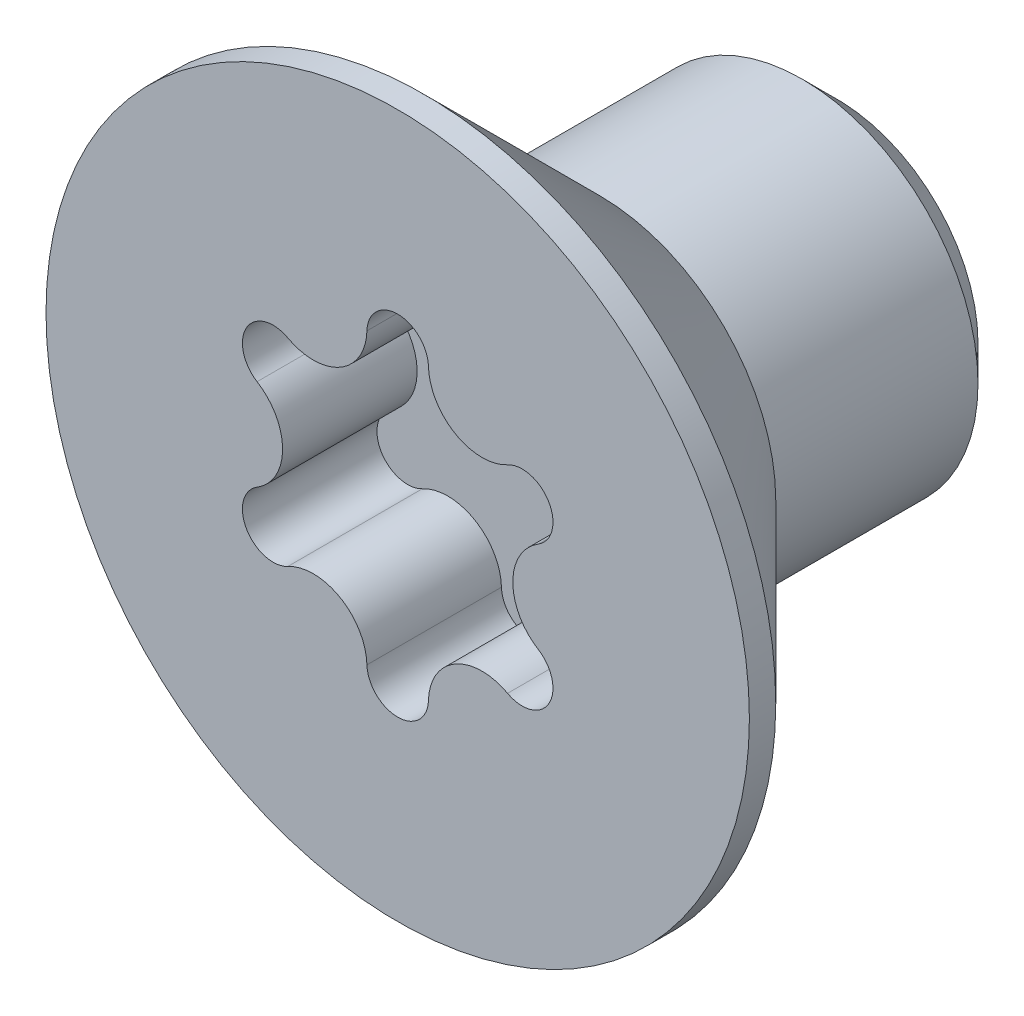
ISO-10303-21;
HEADER;
FILE_DESCRIPTION(('STEP AP214'),'2;1');
FILE_NAME('part.step','',(''),(''),'','','');
FILE_SCHEMA(('AUTOMOTIVE_DESIGN { 1 0 10303 214 1 1 1 1 }'));
ENDSEC;
DATA;
#1=APPLICATION_CONTEXT('core data for automotive mechanical design processes');
#2=APPLICATION_PROTOCOL_DEFINITION('international standard','automotive_design',2000,#1);
#3=PRODUCT_CONTEXT('',#1,'mechanical');
#4=PRODUCT('Part','Part','',(#3));
#5=PRODUCT_RELATED_PRODUCT_CATEGORY('part','',(#4));
#6=PRODUCT_DEFINITION_FORMATION('','',#4);
#7=PRODUCT_DEFINITION_CONTEXT('part definition',#1,'design');
#8=PRODUCT_DEFINITION('design','',#6,#7);
#9=PRODUCT_DEFINITION_SHAPE('','',#8);
#10=(LENGTH_UNIT() NAMED_UNIT(*) SI_UNIT(.MILLI.,.METRE.));
#11=(NAMED_UNIT(*) PLANE_ANGLE_UNIT() SI_UNIT($,.RADIAN.));
#12=(NAMED_UNIT(*) SI_UNIT($,.STERADIAN.) SOLID_ANGLE_UNIT());
#13=UNCERTAINTY_MEASURE_WITH_UNIT(LENGTH_MEASURE(1.E-05),#10,'distance_accuracy_value','');
#14=(GEOMETRIC_REPRESENTATION_CONTEXT(3) GLOBAL_UNCERTAINTY_ASSIGNED_CONTEXT((#13)) GLOBAL_UNIT_ASSIGNED_CONTEXT((#10,
#11,#12)) REPRESENTATION_CONTEXT('',''));
#15=CARTESIAN_POINT('',(0.,0.,0.));
#16=DIRECTION('',(0.,0.,1.));
#17=DIRECTION('',(1.,0.,0.));
#18=AXIS2_PLACEMENT_3D('',#15,#16,#17);
#19=CARTESIAN_POINT('',(0.,0.,2.3));
#20=DIRECTION('',(0.,0.,1.));
#21=DIRECTION('',(1.,0.,0.));
#22=AXIS2_PLACEMENT_3D('',#19,#20,#21);
#23=PLANE('',#22);
#24=CARTESIAN_POINT('',(0.,0.,2.3));
#25=DIRECTION('',(0.,0.,1.));
#26=DIRECTION('',(1.,0.,0.));
#27=AXIS2_PLACEMENT_3D('',#24,#25,#26);
#28=CIRCLE('',#27,4.);
#29=CARTESIAN_POINT('',(4.,0.,2.3));
#30=VERTEX_POINT('',#29);
#31=EDGE_CURVE('E11',#30,#30,#28,.T.);
#32=ORIENTED_EDGE('',*,*,#31,.T.);
#33=EDGE_LOOP('',(#32));
#34=FACE_BOUND('',#33,.T.);
#35=CARTESIAN_POINT('',(1.415951535188,-0.8175,2.3));
#36=DIRECTION('',(0.,0.,-1.));
#37=DIRECTION('',(1.,0.,0.));
#38=AXIS2_PLACEMENT_3D('',#35,#36,#37);
#39=CIRCLE('',#38,0.35);
#40=CARTESIAN_POINT('',(1.599440118764,-0.519453125,2.3));
#41=VERTEX_POINT('',#40);
#42=CARTESIAN_POINT('',(1.249579661707,-1.125429212181,2.3));
#43=VERTEX_POINT('',#42);
#44=EDGE_CURVE('E27',#41,#43,#39,.T.);
#45=ORIENTED_EDGE('',*,*,#44,.T.);
#46=CARTESIAN_POINT('',(0.959617253641,-1.662105839126,2.3));
#47=DIRECTION('',(0.,0.,1.));
#48=DIRECTION('',(1.,0.,0.));
#49=AXIS2_PLACEMENT_3D('',#46,#47,#48);
#50=CIRCLE('',#49,0.61);
#51=CARTESIAN_POINT('',(0.349860457057,-1.644882337181,2.3));
#52=VERTEX_POINT('',#51);
#53=EDGE_CURVE('E175',#43,#52,#50,.T.);
#54=ORIENTED_EDGE('',*,*,#53,.T.);
#55=CARTESIAN_POINT('',(0.,-1.635,2.3));
#56=DIRECTION('',(0.,0.,-1.));
#57=DIRECTION('',(1.,0.,0.));
#58=AXIS2_PLACEMENT_3D('',#55,#56,#57);
#59=CIRCLE('',#58,0.35);
#60=CARTESIAN_POINT('',(-0.349860457057,-1.644882337181,2.3));
#61=VERTEX_POINT('',#60);
#62=EDGE_CURVE('E179',#52,#61,#59,.T.);
#63=ORIENTED_EDGE('',*,*,#62,.T.);
#64=CARTESIAN_POINT('',(-0.959617253641,-1.662105839126,2.3));
#65=DIRECTION('',(0.,0.,1.));
#66=DIRECTION('',(1.,0.,0.));
#67=AXIS2_PLACEMENT_3D('',#64,#65,#66);
#68=CIRCLE('',#67,0.61);
#69=CARTESIAN_POINT('',(-1.249579661707,-1.125429212181,2.3));
#70=VERTEX_POINT('',#69);
#71=EDGE_CURVE('E227',#61,#70,#68,.T.);
#72=ORIENTED_EDGE('',*,*,#71,.T.);
#73=CARTESIAN_POINT('',(-1.415951535188,-0.8175,2.3));
#74=DIRECTION('',(0.,0.,-1.));
#75=DIRECTION('',(1.,0.,0.));
#76=AXIS2_PLACEMENT_3D('',#73,#74,#75);
#77=CIRCLE('',#76,0.35);
#78=CARTESIAN_POINT('',(-1.599440118764,-0.519453125,2.3));
#79=VERTEX_POINT('',#78);
#80=EDGE_CURVE('E223',#70,#79,#77,.T.);
#81=ORIENTED_EDGE('',*,*,#80,.T.);
#82=CARTESIAN_POINT('',(-1.919234507282,0.,2.3));
#83=DIRECTION('',(0.,0.,1.));
#84=DIRECTION('',(1.,0.,0.));
#85=AXIS2_PLACEMENT_3D('',#82,#83,#84);
#86=CIRCLE('',#85,0.61);
#87=CARTESIAN_POINT('',(-1.599440118764,0.519453125,2.3));
#88=VERTEX_POINT('',#87);
#89=EDGE_CURVE('E163',#79,#88,#86,.T.);
#90=ORIENTED_EDGE('',*,*,#89,.T.);
#91=CARTESIAN_POINT('',(-1.415951535188,0.8175,2.3));
#92=DIRECTION('',(0.,0.,-1.));
#93=DIRECTION('',(1.,0.,0.));
#94=AXIS2_PLACEMENT_3D('',#91,#92,#93);
#95=CIRCLE('',#94,0.35);
#96=CARTESIAN_POINT('',(-1.249579661707,1.125429212181,2.3));
#97=VERTEX_POINT('',#96);
#98=EDGE_CURVE('E159',#88,#97,#95,.T.);
#99=ORIENTED_EDGE('',*,*,#98,.T.);
#100=CARTESIAN_POINT('',(-0.959617253641,1.662105839126,2.3));
#101=DIRECTION('',(0.,0.,1.));
#102=DIRECTION('',(1.,0.,0.));
#103=AXIS2_PLACEMENT_3D('',#100,#101,#102);
#104=CIRCLE('',#103,0.61);
#105=CARTESIAN_POINT('',(-0.349860457057,1.644882337181,2.3));
#106=VERTEX_POINT('',#105);
#107=EDGE_CURVE('E164',#97,#106,#104,.T.);
#108=ORIENTED_EDGE('',*,*,#107,.T.);
#109=CARTESIAN_POINT('',(0.,1.635,2.3));
#110=DIRECTION('',(0.,0.,-1.));
#111=DIRECTION('',(1.,0.,0.));
#112=AXIS2_PLACEMENT_3D('',#109,#110,#111);
#113=CIRCLE('',#112,0.35);
#114=CARTESIAN_POINT('',(0.349860457057,1.644882337181,2.3));
#115=VERTEX_POINT('',#114);
#116=EDGE_CURVE('E273',#106,#115,#113,.T.);
#117=ORIENTED_EDGE('',*,*,#116,.T.);
#118=CARTESIAN_POINT('',(0.959617253641,1.662105839126,2.3));
#119=DIRECTION('',(0.,0.,1.));
#120=DIRECTION('',(1.,0.,0.));
#121=AXIS2_PLACEMENT_3D('',#118,#119,#120);
#122=CIRCLE('',#121,0.61);
#123=CARTESIAN_POINT('',(1.249579661707,1.125429212181,2.3));
#124=VERTEX_POINT('',#123);
#125=EDGE_CURVE('E195',#115,#124,#122,.T.);
#126=ORIENTED_EDGE('',*,*,#125,.T.);
#127=CARTESIAN_POINT('',(1.415951535188,0.8175,2.3));
#128=DIRECTION('',(0.,0.,-1.));
#129=DIRECTION('',(1.,0.,0.));
#130=AXIS2_PLACEMENT_3D('',#127,#128,#129);
#131=CIRCLE('',#130,0.35);
#132=CARTESIAN_POINT('',(1.599440118764,0.519453125,2.3));
#133=VERTEX_POINT('',#132);
#134=EDGE_CURVE('E126',#124,#133,#131,.T.);
#135=ORIENTED_EDGE('',*,*,#134,.T.);
#136=CARTESIAN_POINT('',(1.919234507282,0.,2.3));
#137=DIRECTION('',(0.,0.,1.));
#138=DIRECTION('',(1.,0.,0.));
#139=AXIS2_PLACEMENT_3D('',#136,#137,#138);
#140=CIRCLE('',#139,0.61);
#141=EDGE_CURVE('E157',#133,#41,#140,.T.);
#142=ORIENTED_EDGE('',*,*,#141,.T.);
#143=EDGE_LOOP('',(#45,#54,#63,#72,#81,#90,#99,#108,#117,#126,#135,#142));
#144=FACE_BOUND('',#143,.T.);
#145=ADVANCED_FACE('F17',(#34,#144),#23,.T.);
#146=CARTESIAN_POINT('',(0.,0.,2.3));
#147=DIRECTION('',(0.,0.,-1.));
#148=DIRECTION('',(1.,0.,0.));
#149=AXIS2_PLACEMENT_3D('',#146,#147,#148);
#150=CYLINDRICAL_SURFACE('',#149,4.);
#151=DIRECTION('',(0.,0.,-1.));
#152=VECTOR('',#151,1.);
#153=CARTESIAN_POINT('',(4.,0.,2.3));
#154=LINE('',#153,#152);
#155=CARTESIAN_POINT('',(4.,0.,2.));
#156=VERTEX_POINT('',#155);
#157=EDGE_CURVE('E155',#30,#156,#154,.T.);
#158=ORIENTED_EDGE('',*,*,#157,.T.);
#159=CARTESIAN_POINT('',(0.,0.,2.));
#160=DIRECTION('',(0.,0.,1.));
#161=DIRECTION('',(1.,0.,0.));
#162=AXIS2_PLACEMENT_3D('',#159,#160,#161);
#163=CIRCLE('',#162,4.);
#164=EDGE_CURVE('E158',#156,#156,#163,.T.);
#165=ORIENTED_EDGE('',*,*,#164,.T.);
#166=ORIENTED_EDGE('',*,*,#157,.F.);
#167=ORIENTED_EDGE('',*,*,#31,.F.);
#168=EDGE_LOOP('',(#158,#165,#166,#167));
#169=FACE_BOUND('',#168,.T.);
#170=ADVANCED_FACE('F361',(#169),#150,.T.);
#171=CARTESIAN_POINT('',(1.919234507282,0.,0.77));
#172=DIRECTION('',(0.,0.,-1.));
#173=DIRECTION('',(1.,0.,0.));
#174=AXIS2_PLACEMENT_3D('',#171,#172,#173);
#175=CYLINDRICAL_SURFACE('',#174,0.61);
#176=CARTESIAN_POINT('',(1.919234507282,0.,0.77));
#177=DIRECTION('',(0.,0.,1.));
#178=DIRECTION('',(1.,0.,0.));
#179=AXIS2_PLACEMENT_3D('',#176,#177,#178);
#180=CIRCLE('',#179,0.61);
#181=CARTESIAN_POINT('',(1.599440118764,0.519453125,0.77));
#182=VERTEX_POINT('',#181);
#183=CARTESIAN_POINT('',(1.599440118764,-0.519453125,0.77));
#184=VERTEX_POINT('',#183);
#185=EDGE_CURVE('E145',#182,#184,#180,.T.);
#186=ORIENTED_EDGE('',*,*,#185,.T.);
#187=DIRECTION('',(0.,0.,1.));
#188=VECTOR('',#187,1.);
#189=CARTESIAN_POINT('',(1.599440118764,-0.519453125,0.77));
#190=LINE('',#189,#188);
#191=EDGE_CURVE('E215',#184,#41,#190,.T.);
#192=ORIENTED_EDGE('',*,*,#191,.T.);
#193=ORIENTED_EDGE('',*,*,#141,.F.);
#194=DIRECTION('',(0.,0.,1.));
#195=VECTOR('',#194,1.);
#196=CARTESIAN_POINT('',(1.599440118764,0.519453125,0.77));
#197=LINE('',#196,#195);
#198=EDGE_CURVE('E147',#182,#133,#197,.T.);
#199=ORIENTED_EDGE('',*,*,#198,.F.);
#200=EDGE_LOOP('',(#186,#192,#193,#199));
#201=FACE_BOUND('',#200,.T.);
#202=ADVANCED_FACE('F366',(#201),#175,.T.);
#203=CARTESIAN_POINT('',(1.415951535188,-0.8175,0.77));
#204=DIRECTION('',(0.,0.,-1.));
#205=DIRECTION('',(1.,0.,0.));
#206=AXIS2_PLACEMENT_3D('',#203,#204,#205);
#207=CYLINDRICAL_SURFACE('',#206,0.35);
#208=CARTESIAN_POINT('',(1.415951535188,-0.8175,0.77));
#209=DIRECTION('',(0.,0.,-1.));
#210=DIRECTION('',(1.,0.,0.));
#211=AXIS2_PLACEMENT_3D('',#208,#209,#210);
#212=CIRCLE('',#211,0.35);
#213=CARTESIAN_POINT('',(1.249579661707,-1.125429212181,0.77));
#214=VERTEX_POINT('',#213);
#215=EDGE_CURVE('E219',#184,#214,#212,.T.);
#216=ORIENTED_EDGE('',*,*,#215,.T.);
#217=DIRECTION('',(0.,0.,1.));
#218=VECTOR('',#217,1.);
#219=CARTESIAN_POINT('',(1.249579661707,-1.125429212181,0.77));
#220=LINE('',#219,#218);
#221=EDGE_CURVE('E233',#214,#43,#220,.T.);
#222=ORIENTED_EDGE('',*,*,#221,.T.);
#223=ORIENTED_EDGE('',*,*,#44,.F.);
#224=ORIENTED_EDGE('',*,*,#191,.F.);
#225=EDGE_LOOP('',(#216,#222,#223,#224));
#226=FACE_BOUND('',#225,.T.);
#227=ADVANCED_FACE('F396',(#226),#207,.F.);
#228=CARTESIAN_POINT('',(0.959617253641,-1.662105839126,0.77));
#229=DIRECTION('',(0.,0.,-1.));
#230=DIRECTION('',(1.,0.,0.));
#231=AXIS2_PLACEMENT_3D('',#228,#229,#230);
#232=CYLINDRICAL_SURFACE('',#231,0.61);
#233=CARTESIAN_POINT('',(0.959617253641,-1.662105839126,0.77));
#234=DIRECTION('',(0.,0.,1.));
#235=DIRECTION('',(1.,0.,0.));
#236=AXIS2_PLACEMENT_3D('',#233,#234,#235);
#237=CIRCLE('',#236,0.61);
#238=CARTESIAN_POINT('',(0.349860457057,-1.644882337181,0.77));
#239=VERTEX_POINT('',#238);
#240=EDGE_CURVE('E232',#214,#239,#237,.T.);
#241=ORIENTED_EDGE('',*,*,#240,.T.);
#242=DIRECTION('',(0.,0.,1.));
#243=VECTOR('',#242,1.);
#244=CARTESIAN_POINT('',(0.349860457057,-1.644882337181,0.77));
#245=LINE('',#244,#243);
#246=EDGE_CURVE('E228',#239,#52,#245,.T.);
#247=ORIENTED_EDGE('',*,*,#246,.T.);
#248=ORIENTED_EDGE('',*,*,#53,.F.);
#249=ORIENTED_EDGE('',*,*,#221,.F.);
#250=EDGE_LOOP('',(#241,#247,#248,#249));
#251=FACE_BOUND('',#250,.T.);
#252=ADVANCED_FACE('F394',(#251),#232,.T.);
#253=CARTESIAN_POINT('',(0.,-1.635,0.77));
#254=DIRECTION('',(0.,0.,-1.));
#255=DIRECTION('',(1.,0.,0.));
#256=AXIS2_PLACEMENT_3D('',#253,#254,#255);
#257=CYLINDRICAL_SURFACE('',#256,0.35);
#258=CARTESIAN_POINT('',(0.,-1.635,0.77));
#259=DIRECTION('',(0.,0.,-1.));
#260=DIRECTION('',(1.,0.,0.));
#261=AXIS2_PLACEMENT_3D('',#258,#259,#260);
#262=CIRCLE('',#261,0.35);
#263=CARTESIAN_POINT('',(-0.349860457057,-1.644882337181,0.77));
#264=VERTEX_POINT('',#263);
#265=EDGE_CURVE('E200',#239,#264,#262,.T.);
#266=ORIENTED_EDGE('',*,*,#265,.T.);
#267=DIRECTION('',(0.,0.,1.));
#268=VECTOR('',#267,1.);
#269=CARTESIAN_POINT('',(-0.349860457057,-1.644882337181,0.77));
#270=LINE('',#269,#268);
#271=EDGE_CURVE('E188',#264,#61,#270,.T.);
#272=ORIENTED_EDGE('',*,*,#271,.T.);
#273=ORIENTED_EDGE('',*,*,#62,.F.);
#274=ORIENTED_EDGE('',*,*,#246,.F.);
#275=EDGE_LOOP('',(#266,#272,#273,#274));
#276=FACE_BOUND('',#275,.T.);
#277=ADVANCED_FACE('F390',(#276),#257,.F.);
#278=CARTESIAN_POINT('',(-0.959617253641,-1.662105839126,0.77));
#279=DIRECTION('',(0.,0.,-1.));
#280=DIRECTION('',(1.,0.,0.));
#281=AXIS2_PLACEMENT_3D('',#278,#279,#280);
#282=CYLINDRICAL_SURFACE('',#281,0.61);
#283=CARTESIAN_POINT('',(-0.959617253641,-1.662105839126,0.77));
#284=DIRECTION('',(0.,0.,1.));
#285=DIRECTION('',(1.,0.,0.));
#286=AXIS2_PLACEMENT_3D('',#283,#284,#285);
#287=CIRCLE('',#286,0.61);
#288=CARTESIAN_POINT('',(-1.249579661707,-1.125429212181,0.77));
#289=VERTEX_POINT('',#288);
#290=EDGE_CURVE('E184',#264,#289,#287,.T.);
#291=ORIENTED_EDGE('',*,*,#290,.T.);
#292=DIRECTION('',(0.,0.,1.));
#293=VECTOR('',#292,1.);
#294=CARTESIAN_POINT('',(-1.249579661707,-1.125429212181,0.77));
#295=LINE('',#294,#293);
#296=EDGE_CURVE('E180',#289,#70,#295,.T.);
#297=ORIENTED_EDGE('',*,*,#296,.T.);
#298=ORIENTED_EDGE('',*,*,#71,.F.);
#299=ORIENTED_EDGE('',*,*,#271,.F.);
#300=EDGE_LOOP('',(#291,#297,#298,#299));
#301=FACE_BOUND('',#300,.T.);
#302=ADVANCED_FACE('F387',(#301),#282,.T.);
#303=CARTESIAN_POINT('',(-1.415951535188,-0.8175,0.77));
#304=DIRECTION('',(0.,0.,-1.));
#305=DIRECTION('',(1.,0.,0.));
#306=AXIS2_PLACEMENT_3D('',#303,#304,#305);
#307=CYLINDRICAL_SURFACE('',#306,0.35);
#308=CARTESIAN_POINT('',(-1.415951535188,-0.8175,0.77));
#309=DIRECTION('',(0.,0.,-1.));
#310=DIRECTION('',(1.,0.,0.));
#311=AXIS2_PLACEMENT_3D('',#308,#309,#310);
#312=CIRCLE('',#311,0.35);
#313=CARTESIAN_POINT('',(-1.599440118764,-0.519453125,0.77));
#314=VERTEX_POINT('',#313);
#315=EDGE_CURVE('E20',#289,#314,#312,.T.);
#316=ORIENTED_EDGE('',*,*,#315,.T.);
#317=DIRECTION('',(0.,0.,1.));
#318=VECTOR('',#317,1.);
#319=CARTESIAN_POINT('',(-1.599440118764,-0.519453125,0.77));
#320=LINE('',#319,#318);
#321=EDGE_CURVE('E244',#314,#79,#320,.T.);
#322=ORIENTED_EDGE('',*,*,#321,.T.);
#323=ORIENTED_EDGE('',*,*,#80,.F.);
#324=ORIENTED_EDGE('',*,*,#296,.F.);
#325=EDGE_LOOP('',(#316,#322,#323,#324));
#326=FACE_BOUND('',#325,.T.);
#327=ADVANCED_FACE('F306',(#326),#307,.F.);
#328=CARTESIAN_POINT('',(-1.919234507282,0.,0.77));
#329=DIRECTION('',(0.,0.,-1.));
#330=DIRECTION('',(1.,0.,0.));
#331=AXIS2_PLACEMENT_3D('',#328,#329,#330);
#332=CYLINDRICAL_SURFACE('',#331,0.61);
#333=CARTESIAN_POINT('',(-1.919234507282,0.,0.77));
#334=DIRECTION('',(0.,0.,1.));
#335=DIRECTION('',(1.,0.,0.));
#336=AXIS2_PLACEMENT_3D('',#333,#334,#335);
#337=CIRCLE('',#336,0.61);
#338=CARTESIAN_POINT('',(-1.599440118764,0.519453125,0.77));
#339=VERTEX_POINT('',#338);
#340=EDGE_CURVE('E240',#314,#339,#337,.T.);
#341=ORIENTED_EDGE('',*,*,#340,.T.);
#342=DIRECTION('',(0.,0.,1.));
#343=VECTOR('',#342,1.);
#344=CARTESIAN_POINT('',(-1.599440118764,0.519453125,0.77));
#345=LINE('',#344,#343);
#346=EDGE_CURVE('E205',#339,#88,#345,.T.);
#347=ORIENTED_EDGE('',*,*,#346,.T.);
#348=ORIENTED_EDGE('',*,*,#89,.F.);
#349=ORIENTED_EDGE('',*,*,#321,.F.);
#350=EDGE_LOOP('',(#341,#347,#348,#349));
#351=FACE_BOUND('',#350,.T.);
#352=ADVANCED_FACE('F311',(#351),#332,.T.);
#353=CARTESIAN_POINT('',(-1.415951535188,0.8175,0.77));
#354=DIRECTION('',(0.,0.,-1.));
#355=DIRECTION('',(1.,0.,0.));
#356=AXIS2_PLACEMENT_3D('',#353,#354,#355);
#357=CYLINDRICAL_SURFACE('',#356,0.35);
#358=CARTESIAN_POINT('',(-1.415951535188,0.8175,0.77));
#359=DIRECTION('',(0.,0.,-1.));
#360=DIRECTION('',(1.,0.,0.));
#361=AXIS2_PLACEMENT_3D('',#358,#359,#360);
#362=CIRCLE('',#361,0.35);
#363=CARTESIAN_POINT('',(-1.249579661707,1.125429212181,0.77));
#364=VERTEX_POINT('',#363);
#365=EDGE_CURVE('E201',#339,#364,#362,.T.);
#366=ORIENTED_EDGE('',*,*,#365,.T.);
#367=DIRECTION('',(0.,0.,1.));
#368=VECTOR('',#367,1.);
#369=CARTESIAN_POINT('',(-1.249579661707,1.125429212181,0.77));
#370=LINE('',#369,#368);
#371=EDGE_CURVE('E206',#364,#97,#370,.T.);
#372=ORIENTED_EDGE('',*,*,#371,.T.);
#373=ORIENTED_EDGE('',*,*,#98,.F.);
#374=ORIENTED_EDGE('',*,*,#346,.F.);
#375=EDGE_LOOP('',(#366,#372,#373,#374));
#376=FACE_BOUND('',#375,.T.);
#377=ADVANCED_FACE('F348',(#376),#357,.F.);
#378=CARTESIAN_POINT('',(-0.959617253641,1.662105839126,0.77));
#379=DIRECTION('',(0.,0.,-1.));
#380=DIRECTION('',(1.,0.,0.));
#381=AXIS2_PLACEMENT_3D('',#378,#379,#380);
#382=CYLINDRICAL_SURFACE('',#381,0.61);
#383=CARTESIAN_POINT('',(-0.959617253641,1.662105839126,0.77));
#384=DIRECTION('',(0.,0.,1.));
#385=DIRECTION('',(1.,0.,0.));
#386=AXIS2_PLACEMENT_3D('',#383,#384,#385);
#387=CIRCLE('',#386,0.61);
#388=CARTESIAN_POINT('',(-0.349860457057,1.644882337181,0.77));
#389=VERTEX_POINT('',#388);
#390=EDGE_CURVE('E209',#364,#389,#387,.T.);
#391=ORIENTED_EDGE('',*,*,#390,.T.);
#392=DIRECTION('',(0.,0.,1.));
#393=VECTOR('',#392,1.);
#394=CARTESIAN_POINT('',(-0.349860457057,1.644882337181,0.77));
#395=LINE('',#394,#393);
#396=EDGE_CURVE('E214',#389,#106,#395,.T.);
#397=ORIENTED_EDGE('',*,*,#396,.T.);
#398=ORIENTED_EDGE('',*,*,#107,.F.);
#399=ORIENTED_EDGE('',*,*,#371,.F.);
#400=EDGE_LOOP('',(#391,#397,#398,#399));
#401=FACE_BOUND('',#400,.T.);
#402=ADVANCED_FACE('F346',(#401),#382,.T.);
#403=CARTESIAN_POINT('',(0.,1.635,0.77));
#404=DIRECTION('',(0.,0.,-1.));
#405=DIRECTION('',(1.,0.,0.));
#406=AXIS2_PLACEMENT_3D('',#403,#404,#405);
#407=CYLINDRICAL_SURFACE('',#406,0.35);
#408=CARTESIAN_POINT('',(0.,1.635,0.77));
#409=DIRECTION('',(0.,0.,-1.));
#410=DIRECTION('',(1.,0.,0.));
#411=AXIS2_PLACEMENT_3D('',#408,#409,#410);
#412=CIRCLE('',#411,0.35);
#413=CARTESIAN_POINT('',(0.349860457057,1.644882337181,0.77));
#414=VERTEX_POINT('',#413);
#415=EDGE_CURVE('E222',#389,#414,#412,.T.);
#416=ORIENTED_EDGE('',*,*,#415,.T.);
#417=DIRECTION('',(0.,0.,1.));
#418=VECTOR('',#417,1.);
#419=CARTESIAN_POINT('',(0.349860457057,1.644882337181,0.77));
#420=LINE('',#419,#418);
#421=EDGE_CURVE('E135',#414,#115,#420,.T.);
#422=ORIENTED_EDGE('',*,*,#421,.T.);
#423=ORIENTED_EDGE('',*,*,#116,.F.);
#424=ORIENTED_EDGE('',*,*,#396,.F.);
#425=EDGE_LOOP('',(#416,#422,#423,#424));
#426=FACE_BOUND('',#425,.T.);
#427=ADVANCED_FACE('F344',(#426),#407,.F.);
#428=CARTESIAN_POINT('',(0.959617253641,1.662105839126,0.77));
#429=DIRECTION('',(0.,0.,-1.));
#430=DIRECTION('',(1.,0.,0.));
#431=AXIS2_PLACEMENT_3D('',#428,#429,#430);
#432=CYLINDRICAL_SURFACE('',#431,0.61);
#433=CARTESIAN_POINT('',(0.959617253641,1.662105839126,0.77));
#434=DIRECTION('',(0.,0.,1.));
#435=DIRECTION('',(1.,0.,0.));
#436=AXIS2_PLACEMENT_3D('',#433,#434,#435);
#437=CIRCLE('',#436,0.61);
#438=CARTESIAN_POINT('',(1.249579661707,1.125429212181,0.77));
#439=VERTEX_POINT('',#438);
#440=EDGE_CURVE('E130',#414,#439,#437,.T.);
#441=ORIENTED_EDGE('',*,*,#440,.T.);
#442=DIRECTION('',(0.,0.,1.));
#443=VECTOR('',#442,1.);
#444=CARTESIAN_POINT('',(1.249579661707,1.125429212181,0.77));
#445=LINE('',#444,#443);
#446=EDGE_CURVE('E119',#439,#124,#445,.T.);
#447=ORIENTED_EDGE('',*,*,#446,.T.);
#448=ORIENTED_EDGE('',*,*,#125,.F.);
#449=ORIENTED_EDGE('',*,*,#421,.F.);
#450=EDGE_LOOP('',(#441,#447,#448,#449));
#451=FACE_BOUND('',#450,.T.);
#452=ADVANCED_FACE('F133',(#451),#432,.T.);
#453=CARTESIAN_POINT('',(1.415951535188,0.8175,0.77));
#454=DIRECTION('',(0.,0.,-1.));
#455=DIRECTION('',(1.,0.,0.));
#456=AXIS2_PLACEMENT_3D('',#453,#454,#455);
#457=CYLINDRICAL_SURFACE('',#456,0.35);
#458=CARTESIAN_POINT('',(1.415951535188,0.8175,0.77));
#459=DIRECTION('',(0.,0.,-1.));
#460=DIRECTION('',(1.,0.,0.));
#461=AXIS2_PLACEMENT_3D('',#458,#459,#460);
#462=CIRCLE('',#461,0.35);
#463=EDGE_CURVE('E124',#439,#182,#462,.T.);
#464=ORIENTED_EDGE('',*,*,#463,.T.);
#465=ORIENTED_EDGE('',*,*,#198,.T.);
#466=ORIENTED_EDGE('',*,*,#134,.F.);
#467=ORIENTED_EDGE('',*,*,#446,.F.);
#468=EDGE_LOOP('',(#464,#465,#466,#467));
#469=FACE_BOUND('',#468,.T.);
#470=ADVANCED_FACE('F121',(#469),#457,.F.);
#471=CARTESIAN_POINT('',(0.,0.,2.));
#472=DIRECTION('',(0.,0.,1.));
#473=DIRECTION('',(1.,0.,0.));
#474=AXIS2_PLACEMENT_3D('',#471,#472,#473);
#475=CONICAL_SURFACE('',#474,4.,0.785398163397);
#476=DIRECTION('',(-0.707106781186548,0.,-0.707106781186548));
#477=VECTOR('',#476,1.);
#478=CARTESIAN_POINT('',(4.,0.,2.));
#479=LINE('',#478,#477);
#480=CARTESIAN_POINT('',(2.,0.,0.));
#481=VERTEX_POINT('',#480);
#482=EDGE_CURVE('E152',#156,#481,#479,.T.);
#483=ORIENTED_EDGE('',*,*,#482,.T.);
#484=CARTESIAN_POINT('',(0.,0.,0.));
#485=DIRECTION('',(0.,0.,1.));
#486=DIRECTION('',(1.,0.,0.));
#487=AXIS2_PLACEMENT_3D('',#484,#485,#486);
#488=CIRCLE('',#487,2.);
#489=EDGE_CURVE('E165',#481,#481,#488,.T.);
#490=ORIENTED_EDGE('',*,*,#489,.T.);
#491=ORIENTED_EDGE('',*,*,#482,.F.);
#492=ORIENTED_EDGE('',*,*,#164,.F.);
#493=EDGE_LOOP('',(#483,#490,#491,#492));
#494=FACE_BOUND('',#493,.T.);
#495=ADVANCED_FACE('F369',(#494),#475,.T.);
#496=CARTESIAN_POINT('',(0.,0.,0.77));
#497=DIRECTION('',(0.,0.,1.));
#498=DIRECTION('',(1.,0.,0.));
#499=AXIS2_PLACEMENT_3D('',#496,#497,#498);
#500=PLANE('',#499);
#501=ORIENTED_EDGE('',*,*,#463,.F.);
#502=ORIENTED_EDGE('',*,*,#440,.F.);
#503=ORIENTED_EDGE('',*,*,#415,.F.);
#504=ORIENTED_EDGE('',*,*,#390,.F.);
#505=ORIENTED_EDGE('',*,*,#365,.F.);
#506=ORIENTED_EDGE('',*,*,#340,.F.);
#507=ORIENTED_EDGE('',*,*,#315,.F.);
#508=ORIENTED_EDGE('',*,*,#290,.F.);
#509=ORIENTED_EDGE('',*,*,#265,.F.);
#510=ORIENTED_EDGE('',*,*,#240,.F.);
#511=ORIENTED_EDGE('',*,*,#215,.F.);
#512=ORIENTED_EDGE('',*,*,#185,.F.);
#513=EDGE_LOOP('',(#501,#502,#503,#504,#505,#506,#507,#508,#509,#510,#511,#512));
#514=FACE_BOUND('',#513,.T.);
#515=ADVANCED_FACE('F142',(#514),#500,.T.);
#516=CARTESIAN_POINT('',(0.,0.,-2.300000000001));
#517=DIRECTION('',(0.,0.,1.));
#518=DIRECTION('',(1.,0.,0.));
#519=AXIS2_PLACEMENT_3D('',#516,#517,#518);
#520=CYLINDRICAL_SURFACE('',#519,2.);
#521=CARTESIAN_POINT('',(0.,0.,-2.300000000001));
#522=DIRECTION('',(0.,0.,1.));
#523=DIRECTION('',(1.,0.,0.));
#524=AXIS2_PLACEMENT_3D('',#521,#522,#523);
#525=CIRCLE('',#524,2.);
#526=CARTESIAN_POINT('',(2.,0.,-2.300000000001));
#527=VERTEX_POINT('',#526);
#528=EDGE_CURVE('E169',#527,#527,#525,.T.);
#529=ORIENTED_EDGE('',*,*,#528,.T.);
#530=DIRECTION('',(0.,0.,1.));
#531=VECTOR('',#530,1.);
#532=CARTESIAN_POINT('',(2.,0.,-2.300000000001));
#533=LINE('',#532,#531);
#534=EDGE_CURVE('E170',#527,#481,#533,.T.);
#535=ORIENTED_EDGE('',*,*,#534,.T.);
#536=ORIENTED_EDGE('',*,*,#489,.F.);
#537=ORIENTED_EDGE('',*,*,#534,.F.);
#538=EDGE_LOOP('',(#529,#535,#536,#537));
#539=FACE_BOUND('',#538,.T.);
#540=ADVANCED_FACE('F372',(#539),#520,.T.);
#541=CARTESIAN_POINT('',(0.,0.,-2.7));
#542=DIRECTION('',(0.,0.,1.));
#543=DIRECTION('',(1.,0.,0.));
#544=AXIS2_PLACEMENT_3D('',#541,#542,#543);
#545=CONICAL_SURFACE('',#544,1.6,0.785398163399);
#546=CARTESIAN_POINT('',(0.,0.,-2.7));
#547=DIRECTION('',(0.,0.,1.));
#548=DIRECTION('',(1.,0.,0.));
#549=AXIS2_PLACEMENT_3D('',#546,#547,#548);
#550=CIRCLE('',#549,1.6);
#551=CARTESIAN_POINT('',(1.6,0.,-2.7));
#552=VERTEX_POINT('',#551);
#553=EDGE_CURVE('E174',#552,#552,#550,.T.);
#554=ORIENTED_EDGE('',*,*,#553,.T.);
#555=DIRECTION('',(0.707106781187548,0.,0.707106781185548));
#556=VECTOR('',#555,1.);
#557=CARTESIAN_POINT('',(1.6,0.,-2.7));
#558=LINE('',#557,#556);
#559=EDGE_CURVE('E261',#552,#527,#558,.T.);
#560=ORIENTED_EDGE('',*,*,#559,.T.);
#561=ORIENTED_EDGE('',*,*,#528,.F.);
#562=ORIENTED_EDGE('',*,*,#559,.F.);
#563=EDGE_LOOP('',(#554,#560,#561,#562));
#564=FACE_BOUND('',#563,.T.);
#565=ADVANCED_FACE('F376',(#564),#545,.T.);
#566=CARTESIAN_POINT('',(0.,0.,-2.7));
#567=DIRECTION('',(0.,0.,1.));
#568=DIRECTION('',(1.,0.,0.));
#569=AXIS2_PLACEMENT_3D('',#566,#567,#568);
#570=PLANE('',#569);
#571=ORIENTED_EDGE('',*,*,#553,.F.);
#572=EDGE_LOOP('',(#571));
#573=FACE_BOUND('',#572,.T.);
#574=ADVANCED_FACE('F378',(#573),#570,.F.);
#575=CLOSED_SHELL('',(#145,#170,#202,#227,#252,#277,#302,#327,#352,#377,#402,#427,#452,#470,
#495,#515,#540,#565,#574));
#576=MANIFOLD_SOLID_BREP('B1',#575);
#577=ADVANCED_BREP_SHAPE_REPRESENTATION('',(#18,#576),#14);
#578=SHAPE_DEFINITION_REPRESENTATION(#9,#577);
ENDSEC;
END-ISO-10303-21;
